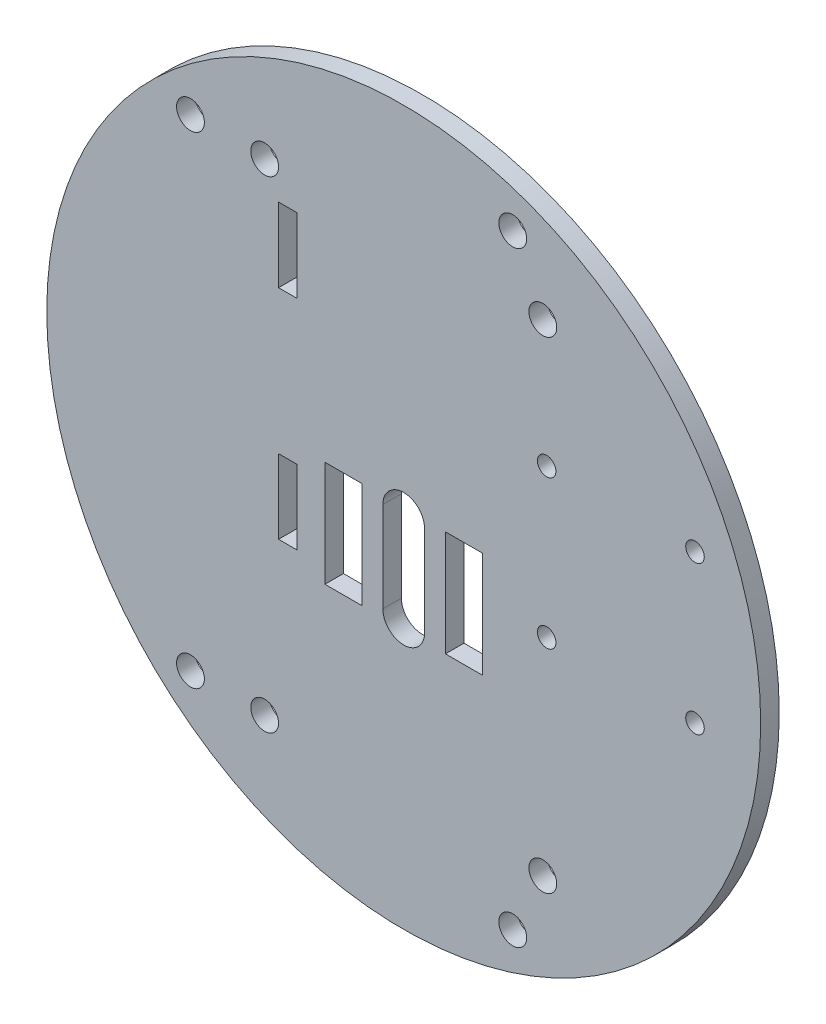
ISO-10303-21;
HEADER;
FILE_DESCRIPTION(('STEP AP214'),'2;1');
FILE_NAME('part.step','',(''),(''),'','','');
FILE_SCHEMA(('AUTOMOTIVE_DESIGN { 1 0 10303 214 1 1 1 1 }'));
ENDSEC;
DATA;
#1=APPLICATION_CONTEXT('core data for automotive mechanical design processes');
#2=APPLICATION_PROTOCOL_DEFINITION('international standard','automotive_design',2000,#1);
#3=PRODUCT_CONTEXT('',#1,'mechanical');
#4=PRODUCT('Part','Part','',(#3));
#5=PRODUCT_RELATED_PRODUCT_CATEGORY('part','',(#4));
#6=PRODUCT_DEFINITION_FORMATION('','',#4);
#7=PRODUCT_DEFINITION_CONTEXT('part definition',#1,'design');
#8=PRODUCT_DEFINITION('design','',#6,#7);
#9=PRODUCT_DEFINITION_SHAPE('','',#8);
#10=(LENGTH_UNIT() NAMED_UNIT(*) SI_UNIT(.MILLI.,.METRE.));
#11=(NAMED_UNIT(*) PLANE_ANGLE_UNIT() SI_UNIT($,.RADIAN.));
#12=(NAMED_UNIT(*) SI_UNIT($,.STERADIAN.) SOLID_ANGLE_UNIT());
#13=UNCERTAINTY_MEASURE_WITH_UNIT(LENGTH_MEASURE(1.E-05),#10,'distance_accuracy_value','');
#14=(GEOMETRIC_REPRESENTATION_CONTEXT(3) GLOBAL_UNCERTAINTY_ASSIGNED_CONTEXT((#13)) GLOBAL_UNIT_ASSIGNED_CONTEXT((#10,
#11,#12)) REPRESENTATION_CONTEXT('',''));
#15=CARTESIAN_POINT('',(0.,0.,0.));
#16=DIRECTION('',(0.,0.,1.));
#17=DIRECTION('',(1.,0.,0.));
#18=AXIS2_PLACEMENT_3D('',#15,#16,#17);
#19=CARTESIAN_POINT('',(0.,-0.0733971724042881,2.));
#20=DIRECTION('',(0.,0.,1.));
#21=DIRECTION('',(1.,0.,0.));
#22=AXIS2_PLACEMENT_3D('',#19,#20,#21);
#23=PLANE('',#22);
#24=DIRECTION('',(0.,-1.,0.));
#25=VECTOR('',#24,1.);
#26=CARTESIAN_POINT('',(-8.49999999999973,0.826602827596723,2.));
#27=LINE('',#26,#25);
#28=CARTESIAN_POINT('',(-8.49999999999973,0.826602827596723,2.));
#29=VERTEX_POINT('',#28);
#30=CARTESIAN_POINT('',(-8.49999999999973,-10.5733971724038,2.));
#31=VERTEX_POINT('',#30);
#32=EDGE_CURVE('E207',#29,#31,#27,.T.);
#33=ORIENTED_EDGE('',*,*,#32,.F.);
#34=DIRECTION('',(-1.,0.,0.));
#35=VECTOR('',#34,1.);
#36=CARTESIAN_POINT('',(-4.49999999999973,0.826602827596723,2.));
#37=LINE('',#36,#35);
#38=CARTESIAN_POINT('',(-4.49999999999973,0.826602827596723,2.));
#39=VERTEX_POINT('',#38);
#40=EDGE_CURVE('E205',#39,#29,#37,.T.);
#41=ORIENTED_EDGE('',*,*,#40,.F.);
#42=DIRECTION('',(0.,1.,0.));
#43=VECTOR('',#42,1.);
#44=CARTESIAN_POINT('',(-4.49999999999973,0.826602827596723,2.));
#45=LINE('',#44,#43);
#46=CARTESIAN_POINT('',(-4.49999999999973,-10.5733971724038,2.));
#47=VERTEX_POINT('',#46);
#48=EDGE_CURVE('E213',#47,#39,#45,.T.);
#49=ORIENTED_EDGE('',*,*,#48,.F.);
#50=DIRECTION('',(1.,0.,0.));
#51=VECTOR('',#50,1.);
#52=CARTESIAN_POINT('',(-8.49999999999973,-10.5733971724038,2.));
#53=LINE('',#52,#51);
#54=EDGE_CURVE('E210',#31,#47,#53,.T.);
#55=ORIENTED_EDGE('',*,*,#54,.F.);
#56=EDGE_LOOP('',(#33,#41,#49,#55));
#57=FACE_BOUND('',#56,.T.);
#58=CARTESIAN_POINT('',(-14.9999999999948,25.9073649411286,2.));
#59=DIRECTION('',(0.,0.,1.));
#60=DIRECTION('',(1.,0.,0.));
#61=AXIS2_PLACEMENT_3D('',#58,#59,#60);
#62=CIRCLE('',#61,1.49999999999538);
#63=CARTESIAN_POINT('',(-13.4999999999994,25.9073649411286,2.));
#64=VERTEX_POINT('',#63);
#65=EDGE_CURVE('E242',#64,#64,#62,.T.);
#66=ORIENTED_EDGE('',*,*,#65,.F.);
#67=EDGE_LOOP('',(#66));
#68=FACE_BOUND('',#67,.T.);
#69=CARTESIAN_POINT('',(-14.9999999999948,-26.0541592859409,2.));
#70=DIRECTION('',(0.,0.,1.));
#71=DIRECTION('',(1.,0.,0.));
#72=AXIS2_PLACEMENT_3D('',#69,#70,#71);
#73=CIRCLE('',#72,1.50000000000006);
#74=CARTESIAN_POINT('',(-13.4999999999947,-26.0541592859409,2.));
#75=VERTEX_POINT('',#74);
#76=EDGE_CURVE('E254',#75,#75,#73,.T.);
#77=ORIENTED_EDGE('',*,*,#76,.F.);
#78=EDGE_LOOP('',(#77));
#79=FACE_BOUND('',#78,.T.);
#80=CARTESIAN_POINT('',(15.4147012959349,-3.57339717240435,2.));
#81=DIRECTION('',(0.,0.,1.));
#82=DIRECTION('',(1.,0.,0.));
#83=AXIS2_PLACEMENT_3D('',#80,#81,#82);
#84=CIRCLE('',#83,0.999999999999888);
#85=CARTESIAN_POINT('',(16.4147012959348,-3.57339717240435,2.));
#86=VERTEX_POINT('',#85);
#87=EDGE_CURVE('E266',#86,#86,#84,.T.);
#88=ORIENTED_EDGE('',*,*,#87,.F.);
#89=EDGE_LOOP('',(#88));
#90=FACE_BOUND('',#89,.T.);
#91=CARTESIAN_POINT('',(31.4147012959345,-3.57339717240435,2.));
#92=DIRECTION('',(0.,0.,1.));
#93=DIRECTION('',(1.,0.,0.));
#94=AXIS2_PLACEMENT_3D('',#91,#92,#93);
#95=CIRCLE('',#94,0.999999999999889);
#96=CARTESIAN_POINT('',(32.4147012959344,-3.57339717240435,2.));
#97=VERTEX_POINT('',#96);
#98=EDGE_CURVE('E278',#97,#97,#95,.T.);
#99=ORIENTED_EDGE('',*,*,#98,.F.);
#100=EDGE_LOOP('',(#99));
#101=FACE_BOUND('',#100,.T.);
#102=DIRECTION('',(0.,-1.,0.));
#103=VECTOR('',#102,1.);
#104=CARTESIAN_POINT('',(-2.25000000000009,0.,2.));
#105=LINE('',#104,#103);
#106=CARTESIAN_POINT('',(-2.25000000000009,0.,2.));
#107=VERTEX_POINT('',#106);
#108=CARTESIAN_POINT('',(-2.25000000000009,-9.74679434480819,2.));
#109=VERTEX_POINT('',#108);
#110=EDGE_CURVE('E292',#107,#109,#105,.T.);
#111=ORIENTED_EDGE('',*,*,#110,.F.);
#112=CARTESIAN_POINT('',(0.,0.,2.));
#113=DIRECTION('',(0.,0.,1.));
#114=DIRECTION('',(1.,0.,0.));
#115=AXIS2_PLACEMENT_3D('',#112,#113,#114);
#116=CIRCLE('',#115,2.25000000000009);
#117=CARTESIAN_POINT('',(2.25000000000009,0.,2.));
#118=VERTEX_POINT('',#117);
#119=EDGE_CURVE('E290',#118,#107,#116,.T.);
#120=ORIENTED_EDGE('',*,*,#119,.F.);
#121=DIRECTION('',(0.,1.,0.));
#122=VECTOR('',#121,1.);
#123=CARTESIAN_POINT('',(2.25000000000009,0.,2.));
#124=LINE('',#123,#122);
#125=CARTESIAN_POINT('',(2.25000000000009,-9.74679434480819,2.));
#126=VERTEX_POINT('',#125);
#127=EDGE_CURVE('E298',#126,#118,#124,.T.);
#128=ORIENTED_EDGE('',*,*,#127,.F.);
#129=CARTESIAN_POINT('',(0.,-9.74679434480819,2.));
#130=DIRECTION('',(0.,0.,1.));
#131=DIRECTION('',(1.,0.,0.));
#132=AXIS2_PLACEMENT_3D('',#129,#130,#131);
#133=CIRCLE('',#132,2.25000000000009);
#134=EDGE_CURVE('E295',#109,#126,#133,.T.);
#135=ORIENTED_EDGE('',*,*,#134,.F.);
#136=EDGE_LOOP('',(#111,#120,#128,#135));
#137=FACE_BOUND('',#136,.T.);
#138=CARTESIAN_POINT('',(11.7571445448976,-32.7195233154898,2.));
#139=DIRECTION('',(0.,0.,1.));
#140=DIRECTION('',(1.,0.,0.));
#141=AXIS2_PLACEMENT_3D('',#138,#139,#140);
#142=CIRCLE('',#141,1.50000000000006);
#143=CARTESIAN_POINT('',(13.2571445448977,-32.7195233154898,2.));
#144=VERTEX_POINT('',#143);
#145=EDGE_CURVE('E327',#144,#144,#142,.T.);
#146=ORIENTED_EDGE('',*,*,#145,.F.);
#147=EDGE_LOOP('',(#146));
#148=FACE_BOUND('',#147,.T.);
#149=DIRECTION('',(1.,0.,0.));
#150=VECTOR('',#149,1.);
#151=CARTESIAN_POINT('',(-13.4999999999997,14.6266028275962,2.));
#152=LINE('',#151,#150);
#153=CARTESIAN_POINT('',(-13.4999999999997,14.6266028275962,2.));
#154=VERTEX_POINT('',#153);
#155=CARTESIAN_POINT('',(-11.4999999999997,14.6266028275962,2.));
#156=VERTEX_POINT('',#155);
#157=EDGE_CURVE('E341',#154,#156,#152,.T.);
#158=ORIENTED_EDGE('',*,*,#157,.F.);
#159=DIRECTION('',(0.,-1.,0.));
#160=VECTOR('',#159,1.);
#161=CARTESIAN_POINT('',(-13.4999999999997,14.6266028275962,2.));
#162=LINE('',#161,#160);
#163=CARTESIAN_POINT('',(-13.4999999999997,22.6266028275962,2.));
#164=VERTEX_POINT('',#163);
#165=EDGE_CURVE('E339',#164,#154,#162,.T.);
#166=ORIENTED_EDGE('',*,*,#165,.F.);
#167=DIRECTION('',(-1.,0.,0.));
#168=VECTOR('',#167,1.);
#169=CARTESIAN_POINT('',(-13.4999999999997,22.6266028275962,2.));
#170=LINE('',#169,#168);
#171=CARTESIAN_POINT('',(-11.4999999999997,22.6266028275962,2.));
#172=VERTEX_POINT('',#171);
#173=EDGE_CURVE('E347',#172,#164,#170,.T.);
#174=ORIENTED_EDGE('',*,*,#173,.F.);
#175=DIRECTION('',(0.,1.,0.));
#176=VECTOR('',#175,1.);
#177=CARTESIAN_POINT('',(-11.4999999999997,22.6266028275962,2.));
#178=LINE('',#177,#176);
#179=EDGE_CURVE('E344',#156,#172,#178,.T.);
#180=ORIENTED_EDGE('',*,*,#179,.F.);
#181=EDGE_LOOP('',(#158,#166,#174,#180));
#182=FACE_BOUND('',#181,.T.);
#183=CARTESIAN_POINT('',(0.,-0.0733971724042881,2.));
#184=DIRECTION('',(0.,0.,1.));
#185=DIRECTION('',(1.,0.,0.));
#186=AXIS2_PLACEMENT_3D('',#183,#184,#185);
#187=CIRCLE('',#186,38.5);
#188=CARTESIAN_POINT('',(38.5,-0.0733971724042881,2.));
#189=VERTEX_POINT('',#188);
#190=EDGE_CURVE('E11',#189,#189,#187,.T.);
#191=ORIENTED_EDGE('',*,*,#190,.T.);
#192=EDGE_LOOP('',(#191));
#193=FACE_BOUND('',#192,.T.);
#194=DIRECTION('',(1.,0.,0.));
#195=VECTOR('',#194,1.);
#196=CARTESIAN_POINT('',(-13.4999999999997,-8.8733971724038,2.));
#197=LINE('',#196,#195);
#198=CARTESIAN_POINT('',(-13.4999999999997,-8.8733971724038,2.));
#199=VERTEX_POINT('',#198);
#200=CARTESIAN_POINT('',(-11.4999999999997,-8.8733971724038,2.));
#201=VERTEX_POINT('',#200);
#202=EDGE_CURVE('E372',#199,#201,#197,.T.);
#203=ORIENTED_EDGE('',*,*,#202,.F.);
#204=DIRECTION('',(0.,-1.,0.));
#205=VECTOR('',#204,1.);
#206=CARTESIAN_POINT('',(-13.4999999999997,-0.873397172403798,2.));
#207=LINE('',#206,#205);
#208=CARTESIAN_POINT('',(-13.4999999999997,-0.873397172403798,2.));
#209=VERTEX_POINT('',#208);
#210=EDGE_CURVE('E370',#209,#199,#207,.T.);
#211=ORIENTED_EDGE('',*,*,#210,.F.);
#212=DIRECTION('',(-1.,0.,0.));
#213=VECTOR('',#212,1.);
#214=CARTESIAN_POINT('',(-11.4999999999997,-0.873397172403798,2.));
#215=LINE('',#214,#213);
#216=CARTESIAN_POINT('',(-11.4999999999997,-0.873397172403798,2.));
#217=VERTEX_POINT('',#216);
#218=EDGE_CURVE('E378',#217,#209,#215,.T.);
#219=ORIENTED_EDGE('',*,*,#218,.F.);
#220=DIRECTION('',(0.,1.,0.));
#221=VECTOR('',#220,1.);
#222=CARTESIAN_POINT('',(-11.4999999999997,-8.8733971724038,2.));
#223=LINE('',#222,#221);
#224=EDGE_CURVE('E375',#201,#217,#223,.T.);
#225=ORIENTED_EDGE('',*,*,#224,.F.);
#226=EDGE_LOOP('',(#203,#211,#219,#225));
#227=FACE_BOUND('',#226,.T.);
#228=CARTESIAN_POINT('',(-23.,26.05,2.));
#229=DIRECTION('',(0.,0.,1.));
#230=DIRECTION('',(1.,0.,0.));
#231=AXIS2_PLACEMENT_3D('',#228,#229,#230);
#232=CIRCLE('',#231,1.50000000000007);
#233=CARTESIAN_POINT('',(-21.4999999999999,26.05,2.));
#234=VERTEX_POINT('',#233);
#235=EDGE_CURVE('E333',#234,#234,#232,.T.);
#236=ORIENTED_EDGE('',*,*,#235,.F.);
#237=EDGE_LOOP('',(#236));
#238=FACE_BOUND('',#237,.T.);
#239=CARTESIAN_POINT('',(11.7571445448976,32.5727289706816,2.));
#240=DIRECTION('',(0.,0.,1.));
#241=DIRECTION('',(1.,0.,0.));
#242=AXIS2_PLACEMENT_3D('',#239,#240,#241);
#243=CIRCLE('',#242,1.50000000000006);
#244=CARTESIAN_POINT('',(13.2571445448977,32.5727289706816,2.));
#245=VERTEX_POINT('',#244);
#246=EDGE_CURVE('E321',#245,#245,#243,.T.);
#247=ORIENTED_EDGE('',*,*,#246,.F.);
#248=EDGE_LOOP('',(#247));
#249=FACE_BOUND('',#248,.T.);
#250=CARTESIAN_POINT('',(31.4147012959345,12.4266028275957,2.));
#251=DIRECTION('',(0.,0.,1.));
#252=DIRECTION('',(1.,0.,0.));
#253=AXIS2_PLACEMENT_3D('',#250,#251,#252);
#254=CIRCLE('',#253,0.999999999999889);
#255=CARTESIAN_POINT('',(32.4147012959344,12.4266028275957,2.));
#256=VERTEX_POINT('',#255);
#257=EDGE_CURVE('E284',#256,#256,#254,.T.);
#258=ORIENTED_EDGE('',*,*,#257,.F.);
#259=EDGE_LOOP('',(#258));
#260=FACE_BOUND('',#259,.T.);
#261=CARTESIAN_POINT('',(15.4147012959349,12.4266028275957,2.));
#262=DIRECTION('',(0.,0.,1.));
#263=DIRECTION('',(1.,0.,0.));
#264=AXIS2_PLACEMENT_3D('',#261,#262,#263);
#265=CIRCLE('',#264,0.999999999999889);
#266=CARTESIAN_POINT('',(16.4147012959348,12.4266028275957,2.));
#267=VERTEX_POINT('',#266);
#268=EDGE_CURVE('E272',#267,#267,#265,.T.);
#269=ORIENTED_EDGE('',*,*,#268,.F.);
#270=EDGE_LOOP('',(#269));
#271=FACE_BOUND('',#270,.T.);
#272=CARTESIAN_POINT('',(-23.,-25.91,2.));
#273=DIRECTION('',(0.,0.,1.));
#274=DIRECTION('',(1.,0.,0.));
#275=AXIS2_PLACEMENT_3D('',#272,#273,#274);
#276=CIRCLE('',#275,1.50000000000006);
#277=CARTESIAN_POINT('',(-21.4999999999999,-25.91,2.));
#278=VERTEX_POINT('',#277);
#279=EDGE_CURVE('E260',#278,#278,#276,.T.);
#280=ORIENTED_EDGE('',*,*,#279,.F.);
#281=EDGE_LOOP('',(#280));
#282=FACE_BOUND('',#281,.T.);
#283=CARTESIAN_POINT('',(15.0000000000001,25.9073649411286,2.));
#284=DIRECTION('',(0.,0.,1.));
#285=DIRECTION('',(1.,0.,0.));
#286=AXIS2_PLACEMENT_3D('',#283,#284,#285);
#287=CIRCLE('',#286,1.49999999999659);
#288=CARTESIAN_POINT('',(16.4999999999967,25.9073649411286,2.));
#289=VERTEX_POINT('',#288);
#290=EDGE_CURVE('E248',#289,#289,#287,.T.);
#291=ORIENTED_EDGE('',*,*,#290,.F.);
#292=EDGE_LOOP('',(#291));
#293=FACE_BOUND('',#292,.T.);
#294=CARTESIAN_POINT('',(15.0000000000001,-26.0541592859409,2.));
#295=DIRECTION('',(0.,0.,1.));
#296=DIRECTION('',(1.,0.,0.));
#297=AXIS2_PLACEMENT_3D('',#294,#295,#296);
#298=CIRCLE('',#297,1.50000000000102);
#299=CARTESIAN_POINT('',(16.5000000000012,-26.0541592859409,2.));
#300=VERTEX_POINT('',#299);
#301=EDGE_CURVE('E236',#300,#300,#298,.T.);
#302=ORIENTED_EDGE('',*,*,#301,.F.);
#303=EDGE_LOOP('',(#302));
#304=FACE_BOUND('',#303,.T.);
#305=DIRECTION('',(0.,-1.,0.));
#306=VECTOR('',#305,1.);
#307=CARTESIAN_POINT('',(4.50000000000017,0.826602827596723,2.));
#308=LINE('',#307,#306);
#309=CARTESIAN_POINT('',(4.50000000000017,0.826602827596723,2.));
#310=VERTEX_POINT('',#309);
#311=CARTESIAN_POINT('',(4.50000000000017,-10.5733971724038,2.));
#312=VERTEX_POINT('',#311);
#313=EDGE_CURVE('E177',#310,#312,#308,.T.);
#314=ORIENTED_EDGE('',*,*,#313,.F.);
#315=DIRECTION('',(-1.,0.,0.));
#316=VECTOR('',#315,1.);
#317=CARTESIAN_POINT('',(4.50000000000017,0.826602827596723,2.));
#318=LINE('',#317,#316);
#319=CARTESIAN_POINT('',(8.50000000000017,0.826602827596725,2.));
#320=VERTEX_POINT('',#319);
#321=EDGE_CURVE('E169',#320,#310,#318,.T.);
#322=ORIENTED_EDGE('',*,*,#321,.F.);
#323=DIRECTION('',(0.,1.,0.));
#324=VECTOR('',#323,1.);
#325=CARTESIAN_POINT('',(8.50000000000018,-10.5733971724038,2.));
#326=LINE('',#325,#324);
#327=CARTESIAN_POINT('',(8.50000000000018,-10.5733971724038,2.));
#328=VERTEX_POINT('',#327);
#329=EDGE_CURVE('E191',#328,#320,#326,.T.);
#330=ORIENTED_EDGE('',*,*,#329,.F.);
#331=DIRECTION('',(1.,0.,0.));
#332=VECTOR('',#331,1.);
#333=CARTESIAN_POINT('',(4.50000000000017,-10.5733971724038,2.));
#334=LINE('',#333,#332);
#335=EDGE_CURVE('E189',#312,#328,#334,.T.);
#336=ORIENTED_EDGE('',*,*,#335,.F.);
#337=EDGE_LOOP('',(#314,#322,#330,#336));
#338=FACE_BOUND('',#337,.T.);
#339=ADVANCED_FACE('F32',(#57,#68,#79,#90,#101,#137,#148,#182,#193,#227,#238,#249,#260,#271,
#282,#293,#304,#338),#23,.T.);
#340=CARTESIAN_POINT('',(0.,-0.0733971724042881,0.));
#341=DIRECTION('',(0.,0.,1.));
#342=DIRECTION('',(1.,0.,0.));
#343=AXIS2_PLACEMENT_3D('',#340,#341,#342);
#344=PLANE('',#343);
#345=DIRECTION('',(-1.,0.,0.));
#346=VECTOR('',#345,1.);
#347=CARTESIAN_POINT('',(-4.49999999999973,0.826602827596723,0.));
#348=LINE('',#347,#346);
#349=CARTESIAN_POINT('',(-4.49999999999973,0.826602827596723,0.));
#350=VERTEX_POINT('',#349);
#351=CARTESIAN_POINT('',(-8.49999999999973,0.826602827596723,0.));
#352=VERTEX_POINT('',#351);
#353=EDGE_CURVE('E185',#350,#352,#348,.T.);
#354=ORIENTED_EDGE('',*,*,#353,.T.);
#355=DIRECTION('',(0.,-1.,0.));
#356=VECTOR('',#355,1.);
#357=CARTESIAN_POINT('',(-8.49999999999973,0.826602827596723,0.));
#358=LINE('',#357,#356);
#359=CARTESIAN_POINT('',(-8.49999999999973,-10.5733971724038,0.));
#360=VERTEX_POINT('',#359);
#361=EDGE_CURVE('E218',#352,#360,#358,.T.);
#362=ORIENTED_EDGE('',*,*,#361,.T.);
#363=DIRECTION('',(1.,0.,0.));
#364=VECTOR('',#363,1.);
#365=CARTESIAN_POINT('',(-8.49999999999973,-10.5733971724038,0.));
#366=LINE('',#365,#364);
#367=CARTESIAN_POINT('',(-4.49999999999973,-10.5733971724038,0.));
#368=VERTEX_POINT('',#367);
#369=EDGE_CURVE('E221',#360,#368,#366,.T.);
#370=ORIENTED_EDGE('',*,*,#369,.T.);
#371=DIRECTION('',(0.,1.,0.));
#372=VECTOR('',#371,1.);
#373=CARTESIAN_POINT('',(-4.49999999999973,0.826602827596723,0.));
#374=LINE('',#373,#372);
#375=EDGE_CURVE('E208',#368,#350,#374,.T.);
#376=ORIENTED_EDGE('',*,*,#375,.T.);
#377=EDGE_LOOP('',(#354,#362,#370,#376));
#378=FACE_BOUND('',#377,.T.);
#379=CARTESIAN_POINT('',(-14.9999999999948,25.9073649411286,0.));
#380=DIRECTION('',(0.,0.,1.));
#381=DIRECTION('',(1.,0.,0.));
#382=AXIS2_PLACEMENT_3D('',#379,#380,#381);
#383=CIRCLE('',#382,1.49999999999538);
#384=CARTESIAN_POINT('',(-13.4999999999994,25.9073649411286,0.));
#385=VERTEX_POINT('',#384);
#386=EDGE_CURVE('E239',#385,#385,#383,.T.);
#387=ORIENTED_EDGE('',*,*,#386,.T.);
#388=EDGE_LOOP('',(#387));
#389=FACE_BOUND('',#388,.T.);
#390=CARTESIAN_POINT('',(-14.9999999999948,-26.0541592859409,0.));
#391=DIRECTION('',(0.,0.,1.));
#392=DIRECTION('',(1.,0.,0.));
#393=AXIS2_PLACEMENT_3D('',#390,#391,#392);
#394=CIRCLE('',#393,1.50000000000006);
#395=CARTESIAN_POINT('',(-13.4999999999947,-26.0541592859409,0.));
#396=VERTEX_POINT('',#395);
#397=EDGE_CURVE('E251',#396,#396,#394,.T.);
#398=ORIENTED_EDGE('',*,*,#397,.T.);
#399=EDGE_LOOP('',(#398));
#400=FACE_BOUND('',#399,.T.);
#401=CARTESIAN_POINT('',(15.4147012959349,-3.57339717240435,0.));
#402=DIRECTION('',(0.,0.,1.));
#403=DIRECTION('',(1.,0.,0.));
#404=AXIS2_PLACEMENT_3D('',#401,#402,#403);
#405=CIRCLE('',#404,0.999999999999888);
#406=CARTESIAN_POINT('',(16.4147012959348,-3.57339717240435,0.));
#407=VERTEX_POINT('',#406);
#408=EDGE_CURVE('E263',#407,#407,#405,.T.);
#409=ORIENTED_EDGE('',*,*,#408,.T.);
#410=EDGE_LOOP('',(#409));
#411=FACE_BOUND('',#410,.T.);
#412=CARTESIAN_POINT('',(31.4147012959345,-3.57339717240435,0.));
#413=DIRECTION('',(0.,0.,1.));
#414=DIRECTION('',(1.,0.,0.));
#415=AXIS2_PLACEMENT_3D('',#412,#413,#414);
#416=CIRCLE('',#415,0.999999999999889);
#417=CARTESIAN_POINT('',(32.4147012959344,-3.57339717240435,0.));
#418=VERTEX_POINT('',#417);
#419=EDGE_CURVE('E275',#418,#418,#416,.T.);
#420=ORIENTED_EDGE('',*,*,#419,.T.);
#421=EDGE_LOOP('',(#420));
#422=FACE_BOUND('',#421,.T.);
#423=CARTESIAN_POINT('',(0.,0.,0.));
#424=DIRECTION('',(0.,0.,1.));
#425=DIRECTION('',(1.,0.,0.));
#426=AXIS2_PLACEMENT_3D('',#423,#424,#425);
#427=CIRCLE('',#426,2.25000000000009);
#428=CARTESIAN_POINT('',(2.25000000000009,0.,0.));
#429=VERTEX_POINT('',#428);
#430=CARTESIAN_POINT('',(-2.25000000000009,0.,0.));
#431=VERTEX_POINT('',#430);
#432=EDGE_CURVE('E287',#429,#431,#427,.T.);
#433=ORIENTED_EDGE('',*,*,#432,.T.);
#434=DIRECTION('',(0.,-1.,0.));
#435=VECTOR('',#434,1.);
#436=CARTESIAN_POINT('',(-2.25000000000009,0.,0.));
#437=LINE('',#436,#435);
#438=CARTESIAN_POINT('',(-2.25000000000009,-9.74679434480819,0.));
#439=VERTEX_POINT('',#438);
#440=EDGE_CURVE('E303',#431,#439,#437,.T.);
#441=ORIENTED_EDGE('',*,*,#440,.T.);
#442=CARTESIAN_POINT('',(0.,-9.74679434480819,0.));
#443=DIRECTION('',(0.,0.,1.));
#444=DIRECTION('',(1.,0.,0.));
#445=AXIS2_PLACEMENT_3D('',#442,#443,#444);
#446=CIRCLE('',#445,2.25000000000009);
#447=CARTESIAN_POINT('',(2.25000000000009,-9.74679434480819,0.));
#448=VERTEX_POINT('',#447);
#449=EDGE_CURVE('E306',#439,#448,#446,.T.);
#450=ORIENTED_EDGE('',*,*,#449,.T.);
#451=DIRECTION('',(0.,1.,0.));
#452=VECTOR('',#451,1.);
#453=CARTESIAN_POINT('',(2.25000000000009,0.,0.));
#454=LINE('',#453,#452);
#455=EDGE_CURVE('E293',#448,#429,#454,.T.);
#456=ORIENTED_EDGE('',*,*,#455,.T.);
#457=EDGE_LOOP('',(#433,#441,#450,#456));
#458=FACE_BOUND('',#457,.T.);
#459=CARTESIAN_POINT('',(11.7571445448976,-32.7195233154898,0.));
#460=DIRECTION('',(0.,0.,1.));
#461=DIRECTION('',(1.,0.,0.));
#462=AXIS2_PLACEMENT_3D('',#459,#460,#461);
#463=CIRCLE('',#462,1.50000000000006);
#464=CARTESIAN_POINT('',(13.2571445448977,-32.7195233154898,0.));
#465=VERTEX_POINT('',#464);
#466=EDGE_CURVE('E324',#465,#465,#463,.T.);
#467=ORIENTED_EDGE('',*,*,#466,.T.);
#468=EDGE_LOOP('',(#467));
#469=FACE_BOUND('',#468,.T.);
#470=DIRECTION('',(0.,-1.,0.));
#471=VECTOR('',#470,1.);
#472=CARTESIAN_POINT('',(-13.4999999999997,14.6266028275962,0.));
#473=LINE('',#472,#471);
#474=CARTESIAN_POINT('',(-13.4999999999997,22.6266028275962,0.));
#475=VERTEX_POINT('',#474);
#476=CARTESIAN_POINT('',(-13.4999999999997,14.6266028275962,0.));
#477=VERTEX_POINT('',#476);
#478=EDGE_CURVE('E336',#475,#477,#473,.T.);
#479=ORIENTED_EDGE('',*,*,#478,.T.);
#480=DIRECTION('',(1.,0.,0.));
#481=VECTOR('',#480,1.);
#482=CARTESIAN_POINT('',(-13.4999999999997,14.6266028275962,0.));
#483=LINE('',#482,#481);
#484=CARTESIAN_POINT('',(-11.4999999999997,14.6266028275962,0.));
#485=VERTEX_POINT('',#484);
#486=EDGE_CURVE('E352',#477,#485,#483,.T.);
#487=ORIENTED_EDGE('',*,*,#486,.T.);
#488=DIRECTION('',(0.,1.,0.));
#489=VECTOR('',#488,1.);
#490=CARTESIAN_POINT('',(-11.4999999999997,22.6266028275962,0.));
#491=LINE('',#490,#489);
#492=CARTESIAN_POINT('',(-11.4999999999997,22.6266028275962,0.));
#493=VERTEX_POINT('',#492);
#494=EDGE_CURVE('E355',#485,#493,#491,.T.);
#495=ORIENTED_EDGE('',*,*,#494,.T.);
#496=DIRECTION('',(-1.,0.,0.));
#497=VECTOR('',#496,1.);
#498=CARTESIAN_POINT('',(-13.4999999999997,22.6266028275962,0.));
#499=LINE('',#498,#497);
#500=EDGE_CURVE('E342',#493,#475,#499,.T.);
#501=ORIENTED_EDGE('',*,*,#500,.T.);
#502=EDGE_LOOP('',(#479,#487,#495,#501));
#503=FACE_BOUND('',#502,.T.);
#504=CARTESIAN_POINT('',(0.,-0.0733971724042881,0.));
#505=DIRECTION('',(0.,0.,1.));
#506=DIRECTION('',(1.,0.,0.));
#507=AXIS2_PLACEMENT_3D('',#504,#505,#506);
#508=CIRCLE('',#507,38.5);
#509=CARTESIAN_POINT('',(38.5,-0.0733971724042881,0.));
#510=VERTEX_POINT('',#509);
#511=EDGE_CURVE('E36',#510,#510,#508,.T.);
#512=ORIENTED_EDGE('',*,*,#511,.F.);
#513=EDGE_LOOP('',(#512));
#514=FACE_BOUND('',#513,.T.);
#515=DIRECTION('',(0.,-1.,0.));
#516=VECTOR('',#515,1.);
#517=CARTESIAN_POINT('',(-13.4999999999997,-0.873397172403798,0.));
#518=LINE('',#517,#516);
#519=CARTESIAN_POINT('',(-13.4999999999997,-0.873397172403798,0.));
#520=VERTEX_POINT('',#519);
#521=CARTESIAN_POINT('',(-13.4999999999997,-8.8733971724038,0.));
#522=VERTEX_POINT('',#521);
#523=EDGE_CURVE('E369',#520,#522,#518,.T.);
#524=ORIENTED_EDGE('',*,*,#523,.T.);
#525=DIRECTION('',(1.,0.,0.));
#526=VECTOR('',#525,1.);
#527=CARTESIAN_POINT('',(-13.4999999999997,-8.8733971724038,0.));
#528=LINE('',#527,#526);
#529=CARTESIAN_POINT('',(-11.4999999999997,-8.8733971724038,0.));
#530=VERTEX_POINT('',#529);
#531=EDGE_CURVE('E383',#522,#530,#528,.T.);
#532=ORIENTED_EDGE('',*,*,#531,.T.);
#533=DIRECTION('',(0.,1.,0.));
#534=VECTOR('',#533,1.);
#535=CARTESIAN_POINT('',(-11.4999999999997,-8.8733971724038,0.));
#536=LINE('',#535,#534);
#537=CARTESIAN_POINT('',(-11.4999999999997,-0.873397172403798,0.));
#538=VERTEX_POINT('',#537);
#539=EDGE_CURVE('E386',#530,#538,#536,.T.);
#540=ORIENTED_EDGE('',*,*,#539,.T.);
#541=DIRECTION('',(-1.,0.,0.));
#542=VECTOR('',#541,1.);
#543=CARTESIAN_POINT('',(-11.4999999999997,-0.873397172403798,0.));
#544=LINE('',#543,#542);
#545=EDGE_CURVE('E373',#538,#520,#544,.T.);
#546=ORIENTED_EDGE('',*,*,#545,.T.);
#547=EDGE_LOOP('',(#524,#532,#540,#546));
#548=FACE_BOUND('',#547,.T.);
#549=CARTESIAN_POINT('',(-23.,26.05,0.));
#550=DIRECTION('',(0.,0.,1.));
#551=DIRECTION('',(1.,0.,0.));
#552=AXIS2_PLACEMENT_3D('',#549,#550,#551);
#553=CIRCLE('',#552,1.50000000000007);
#554=CARTESIAN_POINT('',(-21.4999999999999,26.05,0.));
#555=VERTEX_POINT('',#554);
#556=EDGE_CURVE('E330',#555,#555,#553,.T.);
#557=ORIENTED_EDGE('',*,*,#556,.T.);
#558=EDGE_LOOP('',(#557));
#559=FACE_BOUND('',#558,.T.);
#560=CARTESIAN_POINT('',(11.7571445448976,32.5727289706816,0.));
#561=DIRECTION('',(0.,0.,1.));
#562=DIRECTION('',(1.,0.,0.));
#563=AXIS2_PLACEMENT_3D('',#560,#561,#562);
#564=CIRCLE('',#563,1.50000000000006);
#565=CARTESIAN_POINT('',(13.2571445448977,32.5727289706816,0.));
#566=VERTEX_POINT('',#565);
#567=EDGE_CURVE('E320',#566,#566,#564,.T.);
#568=ORIENTED_EDGE('',*,*,#567,.T.);
#569=EDGE_LOOP('',(#568));
#570=FACE_BOUND('',#569,.T.);
#571=CARTESIAN_POINT('',(31.4147012959345,12.4266028275957,0.));
#572=DIRECTION('',(0.,0.,1.));
#573=DIRECTION('',(1.,0.,0.));
#574=AXIS2_PLACEMENT_3D('',#571,#572,#573);
#575=CIRCLE('',#574,0.999999999999889);
#576=CARTESIAN_POINT('',(32.4147012959344,12.4266028275957,0.));
#577=VERTEX_POINT('',#576);
#578=EDGE_CURVE('E281',#577,#577,#575,.T.);
#579=ORIENTED_EDGE('',*,*,#578,.T.);
#580=EDGE_LOOP('',(#579));
#581=FACE_BOUND('',#580,.T.);
#582=CARTESIAN_POINT('',(15.4147012959349,12.4266028275957,0.));
#583=DIRECTION('',(0.,0.,1.));
#584=DIRECTION('',(1.,0.,0.));
#585=AXIS2_PLACEMENT_3D('',#582,#583,#584);
#586=CIRCLE('',#585,0.999999999999889);
#587=CARTESIAN_POINT('',(16.4147012959348,12.4266028275957,0.));
#588=VERTEX_POINT('',#587);
#589=EDGE_CURVE('E269',#588,#588,#586,.T.);
#590=ORIENTED_EDGE('',*,*,#589,.T.);
#591=EDGE_LOOP('',(#590));
#592=FACE_BOUND('',#591,.T.);
#593=CARTESIAN_POINT('',(-23.,-25.91,0.));
#594=DIRECTION('',(0.,0.,1.));
#595=DIRECTION('',(1.,0.,0.));
#596=AXIS2_PLACEMENT_3D('',#593,#594,#595);
#597=CIRCLE('',#596,1.50000000000006);
#598=CARTESIAN_POINT('',(-21.4999999999999,-25.91,0.));
#599=VERTEX_POINT('',#598);
#600=EDGE_CURVE('E257',#599,#599,#597,.T.);
#601=ORIENTED_EDGE('',*,*,#600,.T.);
#602=EDGE_LOOP('',(#601));
#603=FACE_BOUND('',#602,.T.);
#604=CARTESIAN_POINT('',(15.0000000000001,25.9073649411286,0.));
#605=DIRECTION('',(0.,0.,1.));
#606=DIRECTION('',(1.,0.,0.));
#607=AXIS2_PLACEMENT_3D('',#604,#605,#606);
#608=CIRCLE('',#607,1.49999999999659);
#609=CARTESIAN_POINT('',(16.4999999999967,25.9073649411286,0.));
#610=VERTEX_POINT('',#609);
#611=EDGE_CURVE('E245',#610,#610,#608,.T.);
#612=ORIENTED_EDGE('',*,*,#611,.T.);
#613=EDGE_LOOP('',(#612));
#614=FACE_BOUND('',#613,.T.);
#615=CARTESIAN_POINT('',(15.0000000000001,-26.0541592859409,0.));
#616=DIRECTION('',(0.,0.,1.));
#617=DIRECTION('',(1.,0.,0.));
#618=AXIS2_PLACEMENT_3D('',#615,#616,#617);
#619=CIRCLE('',#618,1.50000000000102);
#620=CARTESIAN_POINT('',(16.5000000000012,-26.0541592859409,0.));
#621=VERTEX_POINT('',#620);
#622=EDGE_CURVE('E235',#621,#621,#619,.T.);
#623=ORIENTED_EDGE('',*,*,#622,.T.);
#624=EDGE_LOOP('',(#623));
#625=FACE_BOUND('',#624,.T.);
#626=DIRECTION('',(-1.,0.,0.));
#627=VECTOR('',#626,1.);
#628=CARTESIAN_POINT('',(4.50000000000017,0.826602827596723,0.));
#629=LINE('',#628,#627);
#630=CARTESIAN_POINT('',(8.50000000000017,0.826602827596725,0.));
#631=VERTEX_POINT('',#630);
#632=CARTESIAN_POINT('',(4.50000000000017,0.826602827596723,0.));
#633=VERTEX_POINT('',#632);
#634=EDGE_CURVE('E55',#631,#633,#629,.T.);
#635=ORIENTED_EDGE('',*,*,#634,.T.);
#636=DIRECTION('',(0.,-1.,0.));
#637=VECTOR('',#636,1.);
#638=CARTESIAN_POINT('',(4.50000000000017,0.826602827596723,0.));
#639=LINE('',#638,#637);
#640=CARTESIAN_POINT('',(4.50000000000017,-10.5733971724038,0.));
#641=VERTEX_POINT('',#640);
#642=EDGE_CURVE('E184',#633,#641,#639,.T.);
#643=ORIENTED_EDGE('',*,*,#642,.T.);
#644=DIRECTION('',(1.,0.,0.));
#645=VECTOR('',#644,1.);
#646=CARTESIAN_POINT('',(4.50000000000017,-10.5733971724038,0.));
#647=LINE('',#646,#645);
#648=CARTESIAN_POINT('',(8.50000000000018,-10.5733971724038,0.));
#649=VERTEX_POINT('',#648);
#650=EDGE_CURVE('E197',#641,#649,#647,.T.);
#651=ORIENTED_EDGE('',*,*,#650,.T.);
#652=DIRECTION('',(0.,1.,0.));
#653=VECTOR('',#652,1.);
#654=CARTESIAN_POINT('',(8.50000000000018,-10.5733971724038,0.));
#655=LINE('',#654,#653);
#656=EDGE_CURVE('E178',#649,#631,#655,.T.);
#657=ORIENTED_EDGE('',*,*,#656,.T.);
#658=EDGE_LOOP('',(#635,#643,#651,#657));
#659=FACE_BOUND('',#658,.T.);
#660=ADVANCED_FACE('F405',(#378,#389,#400,#411,#422,#458,#469,#503,#514,#548,#559,#570,#581,
#592,#603,#614,#625,#659),#344,.F.);
#661=CARTESIAN_POINT('',(0.,-0.0733971724042881,2.));
#662=DIRECTION('',(0.,0.,-1.));
#663=DIRECTION('',(-1.,0.,0.));
#664=AXIS2_PLACEMENT_3D('',#661,#662,#663);
#665=CYLINDRICAL_SURFACE('',#664,38.5);
#666=ORIENTED_EDGE('',*,*,#190,.F.);
#667=EDGE_LOOP('',(#666));
#668=FACE_BOUND('',#667,.T.);
#669=ORIENTED_EDGE('',*,*,#511,.T.);
#670=EDGE_LOOP('',(#669));
#671=FACE_BOUND('',#670,.T.);
#672=ADVANCED_FACE('F34',(#668,#671),#665,.T.);
#673=CARTESIAN_POINT('',(-13.4999999999997,-0.873397172403798,2.));
#674=DIRECTION('',(1.,0.,0.));
#675=DIRECTION('',(0.,1.,0.));
#676=AXIS2_PLACEMENT_3D('',#673,#674,#675);
#677=PLANE('',#676);
#678=ORIENTED_EDGE('',*,*,#523,.F.);
#679=DIRECTION('',(0.,0.,-1.));
#680=VECTOR('',#679,1.);
#681=CARTESIAN_POINT('',(-13.4999999999997,-0.873397172403798,2.));
#682=LINE('',#681,#680);
#683=EDGE_CURVE('E380',#209,#520,#682,.T.);
#684=ORIENTED_EDGE('',*,*,#683,.F.);
#685=ORIENTED_EDGE('',*,*,#210,.T.);
#686=DIRECTION('',(0.,0.,-1.));
#687=VECTOR('',#686,1.);
#688=CARTESIAN_POINT('',(-13.4999999999997,-8.8733971724038,2.));
#689=LINE('',#688,#687);
#690=EDGE_CURVE('E397',#199,#522,#689,.T.);
#691=ORIENTED_EDGE('',*,*,#690,.T.);
#692=EDGE_LOOP('',(#678,#684,#685,#691));
#693=FACE_BOUND('',#692,.T.);
#694=ADVANCED_FACE('F442',(#693),#677,.T.);
#695=CARTESIAN_POINT('',(-13.4999999999997,-8.8733971724038,2.));
#696=DIRECTION('',(0.,1.,0.));
#697=DIRECTION('',(-1.,0.,0.));
#698=AXIS2_PLACEMENT_3D('',#695,#696,#697);
#699=PLANE('',#698);
#700=ORIENTED_EDGE('',*,*,#531,.F.);
#701=ORIENTED_EDGE('',*,*,#690,.F.);
#702=ORIENTED_EDGE('',*,*,#202,.T.);
#703=DIRECTION('',(0.,0.,-1.));
#704=VECTOR('',#703,1.);
#705=CARTESIAN_POINT('',(-11.4999999999997,-8.8733971724038,2.));
#706=LINE('',#705,#704);
#707=EDGE_CURVE('E395',#201,#530,#706,.T.);
#708=ORIENTED_EDGE('',*,*,#707,.T.);
#709=EDGE_LOOP('',(#700,#701,#702,#708));
#710=FACE_BOUND('',#709,.T.);
#711=ADVANCED_FACE('F445',(#710),#699,.T.);
#712=CARTESIAN_POINT('',(-11.4999999999997,-8.8733971724038,2.));
#713=DIRECTION('',(-1.,0.,0.));
#714=DIRECTION('',(0.,-1.,0.));
#715=AXIS2_PLACEMENT_3D('',#712,#713,#714);
#716=PLANE('',#715);
#717=ORIENTED_EDGE('',*,*,#539,.F.);
#718=ORIENTED_EDGE('',*,*,#707,.F.);
#719=ORIENTED_EDGE('',*,*,#224,.T.);
#720=DIRECTION('',(0.,0.,-1.));
#721=VECTOR('',#720,1.);
#722=CARTESIAN_POINT('',(-11.4999999999997,-0.873397172403798,2.));
#723=LINE('',#722,#721);
#724=EDGE_CURVE('E393',#217,#538,#723,.T.);
#725=ORIENTED_EDGE('',*,*,#724,.T.);
#726=EDGE_LOOP('',(#717,#718,#719,#725));
#727=FACE_BOUND('',#726,.T.);
#728=ADVANCED_FACE('F448',(#727),#716,.T.);
#729=CARTESIAN_POINT('',(-11.4999999999997,-0.873397172403798,2.));
#730=DIRECTION('',(0.,-1.,0.));
#731=DIRECTION('',(1.,0.,0.));
#732=AXIS2_PLACEMENT_3D('',#729,#730,#731);
#733=PLANE('',#732);
#734=ORIENTED_EDGE('',*,*,#545,.F.);
#735=ORIENTED_EDGE('',*,*,#724,.F.);
#736=ORIENTED_EDGE('',*,*,#218,.T.);
#737=ORIENTED_EDGE('',*,*,#683,.T.);
#738=EDGE_LOOP('',(#734,#735,#736,#737));
#739=FACE_BOUND('',#738,.T.);
#740=ADVANCED_FACE('F452',(#739),#733,.T.);
#741=CARTESIAN_POINT('',(-13.4999999999997,14.6266028275962,2.));
#742=DIRECTION('',(1.,0.,0.));
#743=DIRECTION('',(0.,1.,0.));
#744=AXIS2_PLACEMENT_3D('',#741,#742,#743);
#745=PLANE('',#744);
#746=ORIENTED_EDGE('',*,*,#478,.F.);
#747=DIRECTION('',(0.,0.,-1.));
#748=VECTOR('',#747,1.);
#749=CARTESIAN_POINT('',(-13.4999999999997,22.6266028275962,2.));
#750=LINE('',#749,#748);
#751=EDGE_CURVE('E349',#164,#475,#750,.T.);
#752=ORIENTED_EDGE('',*,*,#751,.F.);
#753=ORIENTED_EDGE('',*,*,#165,.T.);
#754=DIRECTION('',(0.,0.,-1.));
#755=VECTOR('',#754,1.);
#756=CARTESIAN_POINT('',(-13.4999999999997,14.6266028275962,2.));
#757=LINE('',#756,#755);
#758=EDGE_CURVE('E366',#154,#477,#757,.T.);
#759=ORIENTED_EDGE('',*,*,#758,.T.);
#760=EDGE_LOOP('',(#746,#752,#753,#759));
#761=FACE_BOUND('',#760,.T.);
#762=ADVANCED_FACE('F456',(#761),#745,.T.);
#763=CARTESIAN_POINT('',(-13.4999999999997,14.6266028275962,2.));
#764=DIRECTION('',(0.,1.,0.));
#765=DIRECTION('',(-1.,0.,0.));
#766=AXIS2_PLACEMENT_3D('',#763,#764,#765);
#767=PLANE('',#766);
#768=ORIENTED_EDGE('',*,*,#486,.F.);
#769=ORIENTED_EDGE('',*,*,#758,.F.);
#770=ORIENTED_EDGE('',*,*,#157,.T.);
#771=DIRECTION('',(0.,0.,-1.));
#772=VECTOR('',#771,1.);
#773=CARTESIAN_POINT('',(-11.4999999999997,14.6266028275962,2.));
#774=LINE('',#773,#772);
#775=EDGE_CURVE('E364',#156,#485,#774,.T.);
#776=ORIENTED_EDGE('',*,*,#775,.T.);
#777=EDGE_LOOP('',(#768,#769,#770,#776));
#778=FACE_BOUND('',#777,.T.);
#779=ADVANCED_FACE('F460',(#778),#767,.T.);
#780=CARTESIAN_POINT('',(-11.4999999999997,22.6266028275962,2.));
#781=DIRECTION('',(-1.,0.,0.));
#782=DIRECTION('',(0.,0.,1.));
#783=AXIS2_PLACEMENT_3D('',#780,#781,#782);
#784=PLANE('',#783);
#785=ORIENTED_EDGE('',*,*,#494,.F.);
#786=ORIENTED_EDGE('',*,*,#775,.F.);
#787=ORIENTED_EDGE('',*,*,#179,.T.);
#788=DIRECTION('',(0.,0.,-1.));
#789=VECTOR('',#788,1.);
#790=CARTESIAN_POINT('',(-11.4999999999997,22.6266028275962,2.));
#791=LINE('',#790,#789);
#792=EDGE_CURVE('E362',#172,#493,#791,.T.);
#793=ORIENTED_EDGE('',*,*,#792,.T.);
#794=EDGE_LOOP('',(#785,#786,#787,#793));
#795=FACE_BOUND('',#794,.T.);
#796=ADVANCED_FACE('F464',(#795),#784,.T.);
#797=CARTESIAN_POINT('',(-13.4999999999997,22.6266028275962,2.));
#798=DIRECTION('',(0.,-1.,0.));
#799=DIRECTION('',(0.,0.,-1.));
#800=AXIS2_PLACEMENT_3D('',#797,#798,#799);
#801=PLANE('',#800);
#802=ORIENTED_EDGE('',*,*,#500,.F.);
#803=ORIENTED_EDGE('',*,*,#792,.F.);
#804=ORIENTED_EDGE('',*,*,#173,.T.);
#805=ORIENTED_EDGE('',*,*,#751,.T.);
#806=EDGE_LOOP('',(#802,#803,#804,#805));
#807=FACE_BOUND('',#806,.T.);
#808=ADVANCED_FACE('F468',(#807),#801,.T.);
#809=CARTESIAN_POINT('',(-23.,26.05,2.));
#810=DIRECTION('',(0.,0.,-1.));
#811=DIRECTION('',(-1.,0.,0.));
#812=AXIS2_PLACEMENT_3D('',#809,#810,#811);
#813=CYLINDRICAL_SURFACE('',#812,1.50000000000007);
#814=ORIENTED_EDGE('',*,*,#235,.T.);
#815=EDGE_LOOP('',(#814));
#816=FACE_BOUND('',#815,.T.);
#817=ORIENTED_EDGE('',*,*,#556,.F.);
#818=EDGE_LOOP('',(#817));
#819=FACE_BOUND('',#818,.T.);
#820=ADVANCED_FACE('F472',(#816,#819),#813,.F.);
#821=CARTESIAN_POINT('',(11.7571445448976,-32.7195233154898,2.));
#822=DIRECTION('',(0.,0.,-1.));
#823=DIRECTION('',(-1.,0.,0.));
#824=AXIS2_PLACEMENT_3D('',#821,#822,#823);
#825=CYLINDRICAL_SURFACE('',#824,1.50000000000006);
#826=ORIENTED_EDGE('',*,*,#145,.T.);
#827=EDGE_LOOP('',(#826));
#828=FACE_BOUND('',#827,.T.);
#829=ORIENTED_EDGE('',*,*,#466,.F.);
#830=EDGE_LOOP('',(#829));
#831=FACE_BOUND('',#830,.T.);
#832=ADVANCED_FACE('F476',(#828,#831),#825,.F.);
#833=CARTESIAN_POINT('',(11.7571445448976,32.5727289706816,2.));
#834=DIRECTION('',(0.,0.,-1.));
#835=DIRECTION('',(-1.,0.,0.));
#836=AXIS2_PLACEMENT_3D('',#833,#834,#835);
#837=CYLINDRICAL_SURFACE('',#836,1.50000000000006);
#838=ORIENTED_EDGE('',*,*,#246,.T.);
#839=EDGE_LOOP('',(#838));
#840=FACE_BOUND('',#839,.T.);
#841=ORIENTED_EDGE('',*,*,#567,.F.);
#842=EDGE_LOOP('',(#841));
#843=FACE_BOUND('',#842,.T.);
#844=ADVANCED_FACE('F480',(#840,#843),#837,.F.);
#845=CARTESIAN_POINT('',(0.,0.,2.));
#846=DIRECTION('',(0.,0.,-1.));
#847=DIRECTION('',(-1.,0.,0.));
#848=AXIS2_PLACEMENT_3D('',#845,#846,#847);
#849=CYLINDRICAL_SURFACE('',#848,2.25000000000009);
#850=ORIENTED_EDGE('',*,*,#432,.F.);
#851=DIRECTION('',(0.,0.,-1.));
#852=VECTOR('',#851,1.);
#853=CARTESIAN_POINT('',(2.25000000000009,0.,2.));
#854=LINE('',#853,#852);
#855=EDGE_CURVE('E300',#118,#429,#854,.T.);
#856=ORIENTED_EDGE('',*,*,#855,.F.);
#857=ORIENTED_EDGE('',*,*,#119,.T.);
#858=DIRECTION('',(0.,0.,-1.));
#859=VECTOR('',#858,1.);
#860=CARTESIAN_POINT('',(-2.25000000000009,0.,2.));
#861=LINE('',#860,#859);
#862=EDGE_CURVE('E317',#107,#431,#861,.T.);
#863=ORIENTED_EDGE('',*,*,#862,.T.);
#864=EDGE_LOOP('',(#850,#856,#857,#863));
#865=FACE_BOUND('',#864,.T.);
#866=ADVANCED_FACE('F484',(#865),#849,.F.);
#867=CARTESIAN_POINT('',(-2.25000000000009,0.,2.));
#868=DIRECTION('',(1.,0.,0.));
#869=DIRECTION('',(0.,0.,-1.));
#870=AXIS2_PLACEMENT_3D('',#867,#868,#869);
#871=PLANE('',#870);
#872=ORIENTED_EDGE('',*,*,#440,.F.);
#873=ORIENTED_EDGE('',*,*,#862,.F.);
#874=ORIENTED_EDGE('',*,*,#110,.T.);
#875=DIRECTION('',(0.,0.,-1.));
#876=VECTOR('',#875,1.);
#877=CARTESIAN_POINT('',(-2.25000000000009,-9.74679434480819,2.));
#878=LINE('',#877,#876);
#879=EDGE_CURVE('E315',#109,#439,#878,.T.);
#880=ORIENTED_EDGE('',*,*,#879,.T.);
#881=EDGE_LOOP('',(#872,#873,#874,#880));
#882=FACE_BOUND('',#881,.T.);
#883=ADVANCED_FACE('F488',(#882),#871,.T.);
#884=CARTESIAN_POINT('',(0.,-9.74679434480819,2.));
#885=DIRECTION('',(0.,0.,-1.));
#886=DIRECTION('',(-1.,0.,0.));
#887=AXIS2_PLACEMENT_3D('',#884,#885,#886);
#888=CYLINDRICAL_SURFACE('',#887,2.25000000000009);
#889=ORIENTED_EDGE('',*,*,#449,.F.);
#890=ORIENTED_EDGE('',*,*,#879,.F.);
#891=ORIENTED_EDGE('',*,*,#134,.T.);
#892=DIRECTION('',(0.,0.,-1.));
#893=VECTOR('',#892,1.);
#894=CARTESIAN_POINT('',(2.25000000000009,-9.74679434480819,2.));
#895=LINE('',#894,#893);
#896=EDGE_CURVE('E313',#126,#448,#895,.T.);
#897=ORIENTED_EDGE('',*,*,#896,.T.);
#898=EDGE_LOOP('',(#889,#890,#891,#897));
#899=FACE_BOUND('',#898,.T.);
#900=ADVANCED_FACE('F492',(#899),#888,.F.);
#901=CARTESIAN_POINT('',(2.25000000000009,0.,2.));
#902=DIRECTION('',(-1.,0.,0.));
#903=DIRECTION('',(0.,0.,1.));
#904=AXIS2_PLACEMENT_3D('',#901,#902,#903);
#905=PLANE('',#904);
#906=ORIENTED_EDGE('',*,*,#455,.F.);
#907=ORIENTED_EDGE('',*,*,#896,.F.);
#908=ORIENTED_EDGE('',*,*,#127,.T.);
#909=ORIENTED_EDGE('',*,*,#855,.T.);
#910=EDGE_LOOP('',(#906,#907,#908,#909));
#911=FACE_BOUND('',#910,.T.);
#912=ADVANCED_FACE('F496',(#911),#905,.T.);
#913=CARTESIAN_POINT('',(31.4147012959345,12.4266028275957,2.));
#914=DIRECTION('',(0.,0.,-1.));
#915=DIRECTION('',(-1.,0.,0.));
#916=AXIS2_PLACEMENT_3D('',#913,#914,#915);
#917=CYLINDRICAL_SURFACE('',#916,0.999999999999889);
#918=ORIENTED_EDGE('',*,*,#257,.T.);
#919=EDGE_LOOP('',(#918));
#920=FACE_BOUND('',#919,.T.);
#921=ORIENTED_EDGE('',*,*,#578,.F.);
#922=EDGE_LOOP('',(#921));
#923=FACE_BOUND('',#922,.T.);
#924=ADVANCED_FACE('F500',(#920,#923),#917,.F.);
#925=CARTESIAN_POINT('',(31.4147012959345,-3.57339717240435,2.));
#926=DIRECTION('',(0.,0.,-1.));
#927=DIRECTION('',(-1.,0.,0.));
#928=AXIS2_PLACEMENT_3D('',#925,#926,#927);
#929=CYLINDRICAL_SURFACE('',#928,0.999999999999889);
#930=ORIENTED_EDGE('',*,*,#98,.T.);
#931=EDGE_LOOP('',(#930));
#932=FACE_BOUND('',#931,.T.);
#933=ORIENTED_EDGE('',*,*,#419,.F.);
#934=EDGE_LOOP('',(#933));
#935=FACE_BOUND('',#934,.T.);
#936=ADVANCED_FACE('F504',(#932,#935),#929,.F.);
#937=CARTESIAN_POINT('',(15.4147012959349,12.4266028275957,2.));
#938=DIRECTION('',(0.,0.,-1.));
#939=DIRECTION('',(-1.,0.,0.));
#940=AXIS2_PLACEMENT_3D('',#937,#938,#939);
#941=CYLINDRICAL_SURFACE('',#940,0.999999999999889);
#942=ORIENTED_EDGE('',*,*,#268,.T.);
#943=EDGE_LOOP('',(#942));
#944=FACE_BOUND('',#943,.T.);
#945=ORIENTED_EDGE('',*,*,#589,.F.);
#946=EDGE_LOOP('',(#945));
#947=FACE_BOUND('',#946,.T.);
#948=ADVANCED_FACE('F508',(#944,#947),#941,.F.);
#949=CARTESIAN_POINT('',(15.4147012959349,-3.57339717240435,2.));
#950=DIRECTION('',(0.,0.,-1.));
#951=DIRECTION('',(-1.,0.,0.));
#952=AXIS2_PLACEMENT_3D('',#949,#950,#951);
#953=CYLINDRICAL_SURFACE('',#952,0.999999999999888);
#954=ORIENTED_EDGE('',*,*,#87,.T.);
#955=EDGE_LOOP('',(#954));
#956=FACE_BOUND('',#955,.T.);
#957=ORIENTED_EDGE('',*,*,#408,.F.);
#958=EDGE_LOOP('',(#957));
#959=FACE_BOUND('',#958,.T.);
#960=ADVANCED_FACE('F512',(#956,#959),#953,.F.);
#961=CARTESIAN_POINT('',(-23.,-25.91,2.));
#962=DIRECTION('',(0.,0.,-1.));
#963=DIRECTION('',(-1.,0.,0.));
#964=AXIS2_PLACEMENT_3D('',#961,#962,#963);
#965=CYLINDRICAL_SURFACE('',#964,1.50000000000006);
#966=ORIENTED_EDGE('',*,*,#279,.T.);
#967=EDGE_LOOP('',(#966));
#968=FACE_BOUND('',#967,.T.);
#969=ORIENTED_EDGE('',*,*,#600,.F.);
#970=EDGE_LOOP('',(#969));
#971=FACE_BOUND('',#970,.T.);
#972=ADVANCED_FACE('F516',(#968,#971),#965,.F.);
#973=CARTESIAN_POINT('',(-14.9999999999948,-26.0541592859409,2.));
#974=DIRECTION('',(0.,0.,-1.));
#975=DIRECTION('',(-1.,0.,0.));
#976=AXIS2_PLACEMENT_3D('',#973,#974,#975);
#977=CYLINDRICAL_SURFACE('',#976,1.50000000000006);
#978=ORIENTED_EDGE('',*,*,#76,.T.);
#979=EDGE_LOOP('',(#978));
#980=FACE_BOUND('',#979,.T.);
#981=ORIENTED_EDGE('',*,*,#397,.F.);
#982=EDGE_LOOP('',(#981));
#983=FACE_BOUND('',#982,.T.);
#984=ADVANCED_FACE('F520',(#980,#983),#977,.F.);
#985=CARTESIAN_POINT('',(15.0000000000001,25.9073649411286,2.));
#986=DIRECTION('',(0.,0.,-1.));
#987=DIRECTION('',(-1.,0.,0.));
#988=AXIS2_PLACEMENT_3D('',#985,#986,#987);
#989=CYLINDRICAL_SURFACE('',#988,1.49999999999659);
#990=ORIENTED_EDGE('',*,*,#290,.T.);
#991=EDGE_LOOP('',(#990));
#992=FACE_BOUND('',#991,.T.);
#993=ORIENTED_EDGE('',*,*,#611,.F.);
#994=EDGE_LOOP('',(#993));
#995=FACE_BOUND('',#994,.T.);
#996=ADVANCED_FACE('F524',(#992,#995),#989,.F.);
#997=CARTESIAN_POINT('',(-14.9999999999948,25.9073649411286,2.));
#998=DIRECTION('',(0.,0.,-1.));
#999=DIRECTION('',(-1.,0.,0.));
#1000=AXIS2_PLACEMENT_3D('',#997,#998,#999);
#1001=CYLINDRICAL_SURFACE('',#1000,1.49999999999538);
#1002=ORIENTED_EDGE('',*,*,#65,.T.);
#1003=EDGE_LOOP('',(#1002));
#1004=FACE_BOUND('',#1003,.T.);
#1005=ORIENTED_EDGE('',*,*,#386,.F.);
#1006=EDGE_LOOP('',(#1005));
#1007=FACE_BOUND('',#1006,.T.);
#1008=ADVANCED_FACE('F528',(#1004,#1007),#1001,.F.);
#1009=CARTESIAN_POINT('',(15.0000000000001,-26.0541592859409,2.));
#1010=DIRECTION('',(0.,0.,-1.));
#1011=DIRECTION('',(-1.,0.,0.));
#1012=AXIS2_PLACEMENT_3D('',#1009,#1010,#1011);
#1013=CYLINDRICAL_SURFACE('',#1012,1.50000000000102);
#1014=ORIENTED_EDGE('',*,*,#301,.T.);
#1015=EDGE_LOOP('',(#1014));
#1016=FACE_BOUND('',#1015,.T.);
#1017=ORIENTED_EDGE('',*,*,#622,.F.);
#1018=EDGE_LOOP('',(#1017));
#1019=FACE_BOUND('',#1018,.T.);
#1020=ADVANCED_FACE('F532',(#1016,#1019),#1013,.F.);
#1021=CARTESIAN_POINT('',(-4.49999999999973,0.826602827596723,2.));
#1022=DIRECTION('',(0.,-1.,0.));
#1023=DIRECTION('',(0.,0.,-1.));
#1024=AXIS2_PLACEMENT_3D('',#1021,#1022,#1023);
#1025=PLANE('',#1024);
#1026=ORIENTED_EDGE('',*,*,#353,.F.);
#1027=DIRECTION('',(0.,0.,-1.));
#1028=VECTOR('',#1027,1.);
#1029=CARTESIAN_POINT('',(-4.49999999999973,0.826602827596723,2.));
#1030=LINE('',#1029,#1028);
#1031=EDGE_CURVE('E215',#39,#350,#1030,.T.);
#1032=ORIENTED_EDGE('',*,*,#1031,.F.);
#1033=ORIENTED_EDGE('',*,*,#40,.T.);
#1034=DIRECTION('',(0.,0.,-1.));
#1035=VECTOR('',#1034,1.);
#1036=CARTESIAN_POINT('',(-8.49999999999973,0.826602827596723,2.));
#1037=LINE('',#1036,#1035);
#1038=EDGE_CURVE('E232',#29,#352,#1037,.T.);
#1039=ORIENTED_EDGE('',*,*,#1038,.T.);
#1040=EDGE_LOOP('',(#1026,#1032,#1033,#1039));
#1041=FACE_BOUND('',#1040,.T.);
#1042=ADVANCED_FACE('F536',(#1041),#1025,.T.);
#1043=CARTESIAN_POINT('',(-8.49999999999973,0.826602827596723,2.));
#1044=DIRECTION('',(1.,0.,0.));
#1045=DIRECTION('',(0.,0.,-1.));
#1046=AXIS2_PLACEMENT_3D('',#1043,#1044,#1045);
#1047=PLANE('',#1046);
#1048=ORIENTED_EDGE('',*,*,#361,.F.);
#1049=ORIENTED_EDGE('',*,*,#1038,.F.);
#1050=ORIENTED_EDGE('',*,*,#32,.T.);
#1051=DIRECTION('',(0.,0.,-1.));
#1052=VECTOR('',#1051,1.);
#1053=CARTESIAN_POINT('',(-8.49999999999973,-10.5733971724038,2.));
#1054=LINE('',#1053,#1052);
#1055=EDGE_CURVE('E230',#31,#360,#1054,.T.);
#1056=ORIENTED_EDGE('',*,*,#1055,.T.);
#1057=EDGE_LOOP('',(#1048,#1049,#1050,#1056));
#1058=FACE_BOUND('',#1057,.T.);
#1059=ADVANCED_FACE('F540',(#1058),#1047,.T.);
#1060=CARTESIAN_POINT('',(-8.49999999999973,-10.5733971724038,2.));
#1061=DIRECTION('',(0.,1.,0.));
#1062=DIRECTION('',(0.,0.,1.));
#1063=AXIS2_PLACEMENT_3D('',#1060,#1061,#1062);
#1064=PLANE('',#1063);
#1065=ORIENTED_EDGE('',*,*,#369,.F.);
#1066=ORIENTED_EDGE('',*,*,#1055,.F.);
#1067=ORIENTED_EDGE('',*,*,#54,.T.);
#1068=DIRECTION('',(0.,0.,-1.));
#1069=VECTOR('',#1068,1.);
#1070=CARTESIAN_POINT('',(-4.49999999999973,-10.5733971724038,2.));
#1071=LINE('',#1070,#1069);
#1072=EDGE_CURVE('E228',#47,#368,#1071,.T.);
#1073=ORIENTED_EDGE('',*,*,#1072,.T.);
#1074=EDGE_LOOP('',(#1065,#1066,#1067,#1073));
#1075=FACE_BOUND('',#1074,.T.);
#1076=ADVANCED_FACE('F544',(#1075),#1064,.T.);
#1077=CARTESIAN_POINT('',(-4.49999999999973,0.826602827596723,2.));
#1078=DIRECTION('',(-1.,0.,0.));
#1079=DIRECTION('',(0.,0.,1.));
#1080=AXIS2_PLACEMENT_3D('',#1077,#1078,#1079);
#1081=PLANE('',#1080);
#1082=ORIENTED_EDGE('',*,*,#375,.F.);
#1083=ORIENTED_EDGE('',*,*,#1072,.F.);
#1084=ORIENTED_EDGE('',*,*,#48,.T.);
#1085=ORIENTED_EDGE('',*,*,#1031,.T.);
#1086=EDGE_LOOP('',(#1082,#1083,#1084,#1085));
#1087=FACE_BOUND('',#1086,.T.);
#1088=ADVANCED_FACE('F548',(#1087),#1081,.T.);
#1089=CARTESIAN_POINT('',(4.50000000000017,0.826602827596723,2.));
#1090=DIRECTION('',(0.,-1.,0.));
#1091=DIRECTION('',(1.,0.,0.));
#1092=AXIS2_PLACEMENT_3D('',#1089,#1090,#1091);
#1093=PLANE('',#1092);
#1094=ORIENTED_EDGE('',*,*,#634,.F.);
#1095=DIRECTION('',(0.,0.,-1.));
#1096=VECTOR('',#1095,1.);
#1097=CARTESIAN_POINT('',(8.50000000000017,0.826602827596725,2.));
#1098=LINE('',#1097,#1096);
#1099=EDGE_CURVE('E173',#320,#631,#1098,.T.);
#1100=ORIENTED_EDGE('',*,*,#1099,.F.);
#1101=ORIENTED_EDGE('',*,*,#321,.T.);
#1102=DIRECTION('',(0.,0.,-1.));
#1103=VECTOR('',#1102,1.);
#1104=CARTESIAN_POINT('',(4.50000000000017,0.826602827596723,2.));
#1105=LINE('',#1104,#1103);
#1106=EDGE_CURVE('E172',#310,#633,#1105,.T.);
#1107=ORIENTED_EDGE('',*,*,#1106,.T.);
#1108=EDGE_LOOP('',(#1094,#1100,#1101,#1107));
#1109=FACE_BOUND('',#1108,.T.);
#1110=ADVANCED_FACE('F171',(#1109),#1093,.T.);
#1111=CARTESIAN_POINT('',(4.50000000000017,0.826602827596723,2.));
#1112=DIRECTION('',(1.,0.,0.));
#1113=DIRECTION('',(0.,0.,-1.));
#1114=AXIS2_PLACEMENT_3D('',#1111,#1112,#1113);
#1115=PLANE('',#1114);
#1116=ORIENTED_EDGE('',*,*,#642,.F.);
#1117=ORIENTED_EDGE('',*,*,#1106,.F.);
#1118=ORIENTED_EDGE('',*,*,#313,.T.);
#1119=DIRECTION('',(0.,0.,-1.));
#1120=VECTOR('',#1119,1.);
#1121=CARTESIAN_POINT('',(4.50000000000017,-10.5733971724038,2.));
#1122=LINE('',#1121,#1120);
#1123=EDGE_CURVE('E186',#312,#641,#1122,.T.);
#1124=ORIENTED_EDGE('',*,*,#1123,.T.);
#1125=EDGE_LOOP('',(#1116,#1117,#1118,#1124));
#1126=FACE_BOUND('',#1125,.T.);
#1127=ADVANCED_FACE('F181',(#1126),#1115,.T.);
#1128=CARTESIAN_POINT('',(4.50000000000017,-10.5733971724038,2.));
#1129=DIRECTION('',(0.,1.,0.));
#1130=DIRECTION('',(0.,0.,1.));
#1131=AXIS2_PLACEMENT_3D('',#1128,#1129,#1130);
#1132=PLANE('',#1131);
#1133=ORIENTED_EDGE('',*,*,#650,.F.);
#1134=ORIENTED_EDGE('',*,*,#1123,.F.);
#1135=ORIENTED_EDGE('',*,*,#335,.T.);
#1136=DIRECTION('',(0.,0.,-1.));
#1137=VECTOR('',#1136,1.);
#1138=CARTESIAN_POINT('',(8.50000000000018,-10.5733971724038,2.));
#1139=LINE('',#1138,#1137);
#1140=EDGE_CURVE('E47',#328,#649,#1139,.T.);
#1141=ORIENTED_EDGE('',*,*,#1140,.T.);
#1142=EDGE_LOOP('',(#1133,#1134,#1135,#1141));
#1143=FACE_BOUND('',#1142,.T.);
#1144=ADVANCED_FACE('F427',(#1143),#1132,.T.);
#1145=CARTESIAN_POINT('',(8.50000000000018,-10.5733971724038,2.));
#1146=DIRECTION('',(-1.,0.,0.));
#1147=DIRECTION('',(0.,-1.,0.));
#1148=AXIS2_PLACEMENT_3D('',#1145,#1146,#1147);
#1149=PLANE('',#1148);
#1150=ORIENTED_EDGE('',*,*,#656,.F.);
#1151=ORIENTED_EDGE('',*,*,#1140,.F.);
#1152=ORIENTED_EDGE('',*,*,#329,.T.);
#1153=ORIENTED_EDGE('',*,*,#1099,.T.);
#1154=EDGE_LOOP('',(#1150,#1151,#1152,#1153));
#1155=FACE_BOUND('',#1154,.T.);
#1156=ADVANCED_FACE('F425',(#1155),#1149,.T.);
#1157=CLOSED_SHELL('',(#339,#660,#672,#694,#711,#728,#740,#762,#779,#796,#808,#820,#832,#844,
#866,#883,#900,#912,#924,#936,#948,#960,#972,#984,#996,#1008,#1020,#1042,#1059,#1076,#1088,
#1110,#1127,#1144,#1156));
#1158=MANIFOLD_SOLID_BREP('B2',#1157);
#1159=ADVANCED_BREP_SHAPE_REPRESENTATION('',(#18,#1158),#14);
#1160=SHAPE_DEFINITION_REPRESENTATION(#9,#1159);
ENDSEC;
END-ISO-10303-21;
